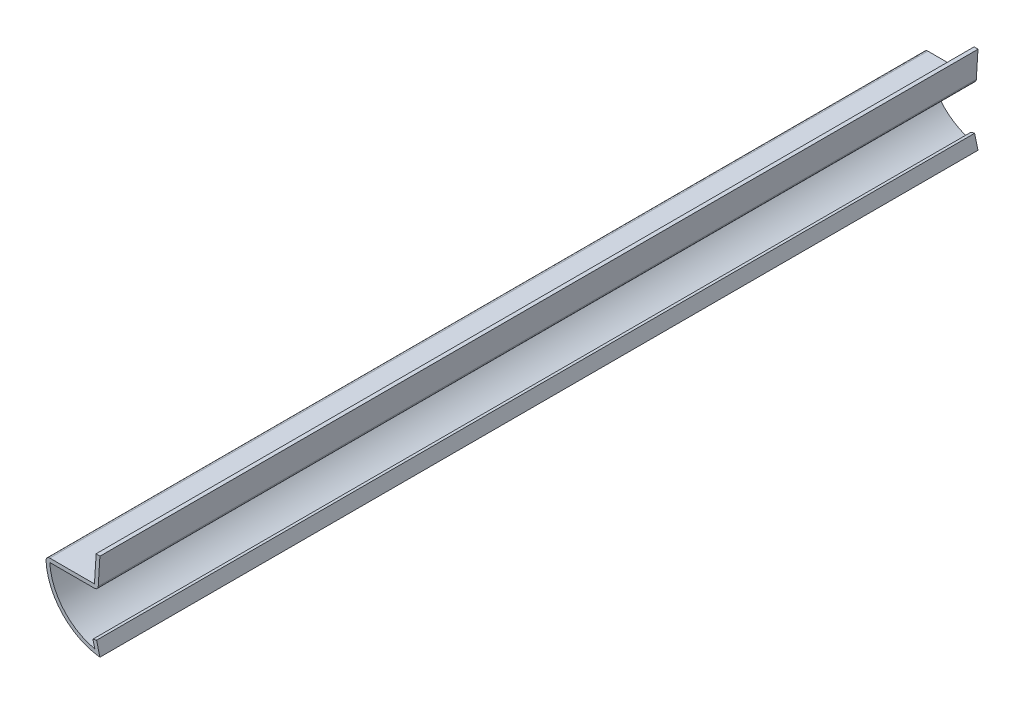
ISO-10303-21;
HEADER;
FILE_DESCRIPTION(('STEP AP214'),'2;1');
FILE_NAME('part.step','',(''),(''),'','','');
FILE_SCHEMA(('AUTOMOTIVE_DESIGN { 1 0 10303 214 1 1 1 1 }'));
ENDSEC;
DATA;
#1=APPLICATION_CONTEXT('core data for automotive mechanical design processes');
#2=APPLICATION_PROTOCOL_DEFINITION('international standard','automotive_design',2000,#1);
#3=PRODUCT_CONTEXT('',#1,'mechanical');
#4=PRODUCT('Part','Part','',(#3));
#5=PRODUCT_RELATED_PRODUCT_CATEGORY('part','',(#4));
#6=PRODUCT_DEFINITION_FORMATION('','',#4);
#7=PRODUCT_DEFINITION_CONTEXT('part definition',#1,'design');
#8=PRODUCT_DEFINITION('design','',#6,#7);
#9=PRODUCT_DEFINITION_SHAPE('','',#8);
#10=(LENGTH_UNIT() NAMED_UNIT(*) SI_UNIT(.MILLI.,.METRE.));
#11=(NAMED_UNIT(*) PLANE_ANGLE_UNIT() SI_UNIT($,.RADIAN.));
#12=(NAMED_UNIT(*) SI_UNIT($,.STERADIAN.) SOLID_ANGLE_UNIT());
#13=UNCERTAINTY_MEASURE_WITH_UNIT(LENGTH_MEASURE(1.E-05),#10,'distance_accuracy_value','');
#14=(GEOMETRIC_REPRESENTATION_CONTEXT(3) GLOBAL_UNCERTAINTY_ASSIGNED_CONTEXT((#13)) GLOBAL_UNIT_ASSIGNED_CONTEXT((#10,
#11,#12)) REPRESENTATION_CONTEXT('',''));
#15=CARTESIAN_POINT('',(0.,0.,0.));
#16=DIRECTION('',(0.,0.,1.));
#17=DIRECTION('',(1.,0.,0.));
#18=AXIS2_PLACEMENT_3D('',#15,#16,#17);
#19=CARTESIAN_POINT('',(-0.398613027077825,14.2319375,-206.375));
#20=DIRECTION('',(0.998044963916957,-0.0625,0.));
#21=DIRECTION('',(0.0625,0.998044963916957,0.));
#22=AXIS2_PLACEMENT_3D('',#19,#20,#21);
#23=PLANE('',#22);
#24=DIRECTION('',(0.0625,0.998044963916957,0.));
#25=VECTOR('',#24,1.);
#26=CARTESIAN_POINT('',(-0.398613027077825,14.2319375,0.));
#27=LINE('',#26,#25);
#28=CARTESIAN_POINT('',(-0.398613027077825,14.2319375,0.));
#29=VERTEX_POINT('',#28);
#30=CARTESIAN_POINT('',(-0.00173802707782516,20.5695230208727,0.));
#31=VERTEX_POINT('',#30);
#32=EDGE_CURVE('E227',#29,#31,#27,.T.);
#33=ORIENTED_EDGE('',*,*,#32,.F.);
#34=DIRECTION('',(0.,0.,1.));
#35=VECTOR('',#34,1.);
#36=CARTESIAN_POINT('',(-0.398613027077825,14.2319375,-206.375));
#37=LINE('',#36,#35);
#38=CARTESIAN_POINT('',(-0.398613027077825,14.2319375,-206.375));
#39=VERTEX_POINT('',#38);
#40=EDGE_CURVE('E131',#29,#39,#37,.F.);
#41=ORIENTED_EDGE('',*,*,#40,.T.);
#42=DIRECTION('',(0.0625,0.998044963916957,0.));
#43=VECTOR('',#42,1.);
#44=CARTESIAN_POINT('',(-0.398613027077825,14.2319375,-206.375));
#45=LINE('',#44,#43);
#46=CARTESIAN_POINT('',(-0.00173802707782516,20.5695230208727,-206.375));
#47=VERTEX_POINT('',#46);
#48=EDGE_CURVE('E124',#39,#47,#45,.T.);
#49=ORIENTED_EDGE('',*,*,#48,.T.);
#50=DIRECTION('',(0.,0.,1.));
#51=VECTOR('',#50,1.);
#52=CARTESIAN_POINT('',(-0.00173802707782516,20.5695230208727,-206.375));
#53=LINE('',#52,#51);
#54=EDGE_CURVE('E128',#47,#31,#53,.T.);
#55=ORIENTED_EDGE('',*,*,#54,.T.);
#56=EDGE_LOOP('',(#33,#41,#49,#55));
#57=FACE_BOUND('',#56,.T.);
#58=ADVANCED_FACE('F35',(#57),#23,.T.);
#59=CARTESIAN_POINT('',(-12.7,13.3985,-206.375));
#60=DIRECTION('',(0.,-1.,0.));
#61=DIRECTION('',(0.,0.,-1.));
#62=AXIS2_PLACEMENT_3D('',#59,#60,#61);
#63=PLANE('',#62);
#64=DIRECTION('',(1.,0.,0.));
#65=VECTOR('',#64,1.);
#66=CARTESIAN_POINT('',(-12.7,13.3985,-206.375));
#67=LINE('',#66,#65);
#68=CARTESIAN_POINT('',(-11.7873354735473,13.3985,-206.375));
#69=VERTEX_POINT('',#68);
#70=CARTESIAN_POINT('',(-1.285875,13.3985,-206.375));
#71=VERTEX_POINT('',#70);
#72=EDGE_CURVE('E148',#69,#71,#67,.T.);
#73=ORIENTED_EDGE('',*,*,#72,.T.);
#74=DIRECTION('',(0.,0.,1.));
#75=VECTOR('',#74,1.);
#76=CARTESIAN_POINT('',(-1.285875,13.3985,-206.375));
#77=LINE('',#76,#75);
#78=CARTESIAN_POINT('',(-1.285875,13.3985,0.));
#79=VERTEX_POINT('',#78);
#80=EDGE_CURVE('E157',#71,#79,#77,.T.);
#81=ORIENTED_EDGE('',*,*,#80,.T.);
#82=DIRECTION('',(1.,0.,0.));
#83=VECTOR('',#82,1.);
#84=CARTESIAN_POINT('',(-12.7,13.3985,0.));
#85=LINE('',#84,#83);
#86=CARTESIAN_POINT('',(-11.7873354735473,13.3985,0.));
#87=VERTEX_POINT('',#86);
#88=EDGE_CURVE('E134',#87,#79,#85,.T.);
#89=ORIENTED_EDGE('',*,*,#88,.F.);
#90=DIRECTION('',(0.,0.,1.));
#91=VECTOR('',#90,1.);
#92=CARTESIAN_POINT('',(-11.7873354735473,13.3985,-206.375));
#93=LINE('',#92,#91);
#94=EDGE_CURVE('E161',#69,#87,#93,.T.);
#95=ORIENTED_EDGE('',*,*,#94,.F.);
#96=EDGE_LOOP('',(#73,#81,#89,#95));
#97=FACE_BOUND('',#96,.T.);
#98=ADVANCED_FACE('F234',(#97),#63,.T.);
#99=CARTESIAN_POINT('',(1.5872262883842,14.1990622563415,-206.375));
#100=DIRECTION('',(0.,0.,1.));
#101=DIRECTION('',(1.,0.,0.));
#102=AXIS2_PLACEMENT_3D('',#99,#100,#101);
#103=CYLINDRICAL_SURFACE('',#102,13.3985);
#104=CARTESIAN_POINT('',(1.5872262883842,14.1990622563415,0.));
#105=DIRECTION('',(0.,0.,1.));
#106=DIRECTION('',(1.,0.,0.));
#107=AXIS2_PLACEMENT_3D('',#104,#105,#106);
#108=CIRCLE('',#107,13.3985);
#109=CARTESIAN_POINT('',(-1.20057239005308,1.093796872592,0.));
#110=VERTEX_POINT('',#109);
#111=EDGE_CURVE('E197',#110,#87,#108,.F.);
#112=ORIENTED_EDGE('',*,*,#111,.F.);
#113=DIRECTION('',(0.,0.,1.));
#114=VECTOR('',#113,1.);
#115=CARTESIAN_POINT('',(-1.20057239005308,1.093796872592,-206.375));
#116=LINE('',#115,#114);
#117=CARTESIAN_POINT('',(-1.20057239005308,1.093796872592,-206.375));
#118=VERTEX_POINT('',#117);
#119=EDGE_CURVE('E202',#118,#110,#116,.T.);
#120=ORIENTED_EDGE('',*,*,#119,.F.);
#121=CARTESIAN_POINT('',(1.5872262883842,14.1990622563415,-206.375));
#122=DIRECTION('',(0.,0.,1.));
#123=DIRECTION('',(1.,0.,0.));
#124=AXIS2_PLACEMENT_3D('',#121,#122,#123);
#125=CIRCLE('',#124,13.3985);
#126=EDGE_CURVE('E153',#118,#69,#125,.F.);
#127=ORIENTED_EDGE('',*,*,#126,.T.);
#128=ORIENTED_EDGE('',*,*,#94,.T.);
#129=EDGE_LOOP('',(#112,#120,#127,#128));
#130=FACE_BOUND('',#129,.T.);
#131=ADVANCED_FACE('F238',(#130),#103,.F.);
#132=CARTESIAN_POINT('',(-1.6545205486946,2.85193053105214,-206.375));
#133=DIRECTION('',(-0.968245836551854,-0.25,0.));
#134=DIRECTION('',(0.25,-0.968245836551854,0.));
#135=AXIS2_PLACEMENT_3D('',#132,#133,#134);
#136=PLANE('',#135);
#137=DIRECTION('',(0.25,-0.968245836551854,0.));
#138=VECTOR('',#137,1.);
#139=CARTESIAN_POINT('',(-1.6545205486946,2.85193053105214,0.));
#140=LINE('',#139,#138);
#141=CARTESIAN_POINT('',(-1.6545205486946,2.85193053105214,0.));
#142=VERTEX_POINT('',#141);
#143=EDGE_CURVE('E194',#142,#110,#140,.T.);
#144=ORIENTED_EDGE('',*,*,#143,.F.);
#145=DIRECTION('',(0.,0.,1.));
#146=VECTOR('',#145,1.);
#147=CARTESIAN_POINT('',(-1.6545205486946,2.85193053105214,-206.375));
#148=LINE('',#147,#146);
#149=CARTESIAN_POINT('',(-1.6545205486946,2.85193053105214,-206.375));
#150=VERTEX_POINT('',#149);
#151=EDGE_CURVE('E204',#150,#142,#148,.T.);
#152=ORIENTED_EDGE('',*,*,#151,.F.);
#153=DIRECTION('',(0.25,-0.968245836551854,0.));
#154=VECTOR('',#153,1.);
#155=CARTESIAN_POINT('',(-1.6545205486946,2.85193053105214,-206.375));
#156=LINE('',#155,#154);
#157=EDGE_CURVE('E222',#150,#118,#156,.T.);
#158=ORIENTED_EDGE('',*,*,#157,.T.);
#159=ORIENTED_EDGE('',*,*,#119,.T.);
#160=EDGE_LOOP('',(#144,#152,#158,#159));
#161=FACE_BOUND('',#160,.T.);
#162=ADVANCED_FACE('F242',(#161),#136,.T.);
#163=CARTESIAN_POINT('',(-1.6545205486946,2.85193053105214,-206.375));
#164=DIRECTION('',(0.25,-0.968245836551854,0.));
#165=DIRECTION('',(0.968245836551854,0.25,0.));
#166=AXIS2_PLACEMENT_3D('',#163,#164,#165);
#167=PLANE('',#166);
#168=DIRECTION('',(0.968245836551854,0.25,0.));
#169=VECTOR('',#168,1.);
#170=CARTESIAN_POINT('',(-1.6545205486946,2.85193053105214,0.));
#171=LINE('',#170,#169);
#172=CARTESIAN_POINT('',(-0.79375,3.07418053105214,0.));
#173=VERTEX_POINT('',#172);
#174=EDGE_CURVE('E192',#142,#173,#171,.T.);
#175=ORIENTED_EDGE('',*,*,#174,.T.);
#176=DIRECTION('',(0.,0.,1.));
#177=VECTOR('',#176,1.);
#178=CARTESIAN_POINT('',(-0.79375,3.07418053105214,-206.375));
#179=LINE('',#178,#177);
#180=CARTESIAN_POINT('',(-0.79375,3.07418053105214,-206.375));
#181=VERTEX_POINT('',#180);
#182=EDGE_CURVE('E206',#181,#173,#179,.T.);
#183=ORIENTED_EDGE('',*,*,#182,.F.);
#184=DIRECTION('',(0.968245836551854,0.25,0.));
#185=VECTOR('',#184,1.);
#186=CARTESIAN_POINT('',(-1.6545205486946,2.85193053105214,-206.375));
#187=LINE('',#186,#185);
#188=EDGE_CURVE('E220',#150,#181,#187,.T.);
#189=ORIENTED_EDGE('',*,*,#188,.F.);
#190=ORIENTED_EDGE('',*,*,#151,.T.);
#191=EDGE_LOOP('',(#175,#183,#189,#190));
#192=FACE_BOUND('',#191,.T.);
#193=ADVANCED_FACE('F247',(#192),#167,.F.);
#194=CARTESIAN_POINT('',(-0.79375,3.07418053105214,-206.375));
#195=DIRECTION('',(-0.968245836551854,-0.25,0.));
#196=DIRECTION('',(0.25,-0.968245836551854,0.));
#197=AXIS2_PLACEMENT_3D('',#194,#195,#196);
#198=PLANE('',#197);
#199=DIRECTION('',(0.25,-0.968245836551854,0.));
#200=VECTOR('',#199,1.);
#201=CARTESIAN_POINT('',(-0.79375,3.07418053105214,0.));
#202=LINE('',#201,#200);
#203=CARTESIAN_POINT('',(0.,0.,0.));
#204=VERTEX_POINT('',#203);
#205=EDGE_CURVE('E186',#173,#204,#202,.T.);
#206=ORIENTED_EDGE('',*,*,#205,.T.);
#207=DIRECTION('',(0.,0.,1.));
#208=VECTOR('',#207,1.);
#209=CARTESIAN_POINT('',(0.,0.,-206.375));
#210=LINE('',#209,#208);
#211=CARTESIAN_POINT('',(0.,0.,-206.375));
#212=VERTEX_POINT('',#211);
#213=EDGE_CURVE('E209',#212,#204,#210,.T.);
#214=ORIENTED_EDGE('',*,*,#213,.F.);
#215=DIRECTION('',(0.25,-0.968245836551854,0.));
#216=VECTOR('',#215,1.);
#217=CARTESIAN_POINT('',(-0.79375,3.07418053105214,-206.375));
#218=LINE('',#217,#216);
#219=EDGE_CURVE('E218',#181,#212,#218,.T.);
#220=ORIENTED_EDGE('',*,*,#219,.F.);
#221=ORIENTED_EDGE('',*,*,#182,.T.);
#222=EDGE_LOOP('',(#206,#214,#220,#221));
#223=FACE_BOUND('',#222,.T.);
#224=ADVANCED_FACE('F251',(#223),#198,.F.);
#225=CARTESIAN_POINT('',(1.5872262883842,14.1990622563415,-206.375));
#226=DIRECTION('',(0.,0.,1.));
#227=DIRECTION('',(1.,0.,0.));
#228=AXIS2_PLACEMENT_3D('',#225,#226,#227);
#229=CYLINDRICAL_SURFACE('',#228,14.2875);
#230=CARTESIAN_POINT('',(1.5872262883842,14.1990622563415,0.));
#231=DIRECTION('',(0.,0.,-1.));
#232=DIRECTION('',(-1.,0.,0.));
#233=AXIS2_PLACEMENT_3D('',#230,#231,#232);
#234=CIRCLE('',#233,14.2875);
#235=CARTESIAN_POINT('',(-12.6747471544338,13.3453821251717,0.));
#236=VERTEX_POINT('',#235);
#237=EDGE_CURVE('E184',#204,#236,#234,.T.);
#238=ORIENTED_EDGE('',*,*,#237,.T.);
#239=DIRECTION('',(0.,0.,1.));
#240=VECTOR('',#239,1.);
#241=CARTESIAN_POINT('',(-12.6747471544338,13.3453821251717,-206.375));
#242=LINE('',#241,#240);
#243=CARTESIAN_POINT('',(-12.6747471544338,13.3453821251717,-206.375));
#244=VERTEX_POINT('',#243);
#245=EDGE_CURVE('E11',#236,#244,#242,.F.);
#246=ORIENTED_EDGE('',*,*,#245,.T.);
#247=CARTESIAN_POINT('',(1.5872262883842,14.1990622563415,-206.375));
#248=DIRECTION('',(0.,0.,-1.));
#249=DIRECTION('',(-1.,0.,0.));
#250=AXIS2_PLACEMENT_3D('',#247,#248,#249);
#251=CIRCLE('',#250,14.2875);
#252=EDGE_CURVE('E214',#212,#244,#251,.T.);
#253=ORIENTED_EDGE('',*,*,#252,.F.);
#254=ORIENTED_EDGE('',*,*,#213,.T.);
#255=EDGE_LOOP('',(#238,#246,#253,#254));
#256=FACE_BOUND('',#255,.T.);
#257=ADVANCED_FACE('F253',(#256),#229,.T.);
#258=CARTESIAN_POINT('',(-12.7,14.2875,-206.375));
#259=DIRECTION('',(0.,-1.,0.));
#260=DIRECTION('',(0.,0.,-1.));
#261=AXIS2_PLACEMENT_3D('',#258,#259,#260);
#262=PLANE('',#261);
#263=DIRECTION('',(1.,0.,0.));
#264=VECTOR('',#263,1.);
#265=CARTESIAN_POINT('',(-12.7,14.2875,-206.375));
#266=LINE('',#265,#264);
#267=CARTESIAN_POINT('',(-11.7873354735473,14.2875,-206.375));
#268=VERTEX_POINT('',#267);
#269=CARTESIAN_POINT('',(-1.285875,14.2875,-206.375));
#270=VERTEX_POINT('',#269);
#271=EDGE_CURVE('E176',#268,#270,#266,.T.);
#272=ORIENTED_EDGE('',*,*,#271,.F.);
#273=DIRECTION('',(0.,0.,1.));
#274=VECTOR('',#273,1.);
#275=CARTESIAN_POINT('',(-11.7873354735473,14.2875,-206.375));
#276=LINE('',#275,#274);
#277=CARTESIAN_POINT('',(-11.7873354735473,14.2875,0.));
#278=VERTEX_POINT('',#277);
#279=EDGE_CURVE('E43',#268,#278,#276,.T.);
#280=ORIENTED_EDGE('',*,*,#279,.T.);
#281=DIRECTION('',(1.,0.,0.));
#282=VECTOR('',#281,1.);
#283=CARTESIAN_POINT('',(-12.7,14.2875,0.));
#284=LINE('',#283,#282);
#285=CARTESIAN_POINT('',(-1.285875,14.2875,0.));
#286=VERTEX_POINT('',#285);
#287=EDGE_CURVE('E174',#278,#286,#284,.T.);
#288=ORIENTED_EDGE('',*,*,#287,.T.);
#289=DIRECTION('',(0.,0.,1.));
#290=VECTOR('',#289,1.);
#291=CARTESIAN_POINT('',(-1.285875,14.2875,-206.375));
#292=LINE('',#291,#290);
#293=EDGE_CURVE('E150',#270,#286,#292,.T.);
#294=ORIENTED_EDGE('',*,*,#293,.F.);
#295=EDGE_LOOP('',(#272,#280,#288,#294));
#296=FACE_BOUND('',#295,.T.);
#297=ADVANCED_FACE('F172',(#296),#262,.F.);
#298=CARTESIAN_POINT('',(-1.285875,14.2875,-206.375));
#299=DIRECTION('',(0.998044963916957,-0.0625,0.));
#300=DIRECTION('',(0.0625,0.998044963916957,0.));
#301=AXIS2_PLACEMENT_3D('',#298,#299,#300);
#302=PLANE('',#301);
#303=DIRECTION('',(0.0625,0.998044963916957,0.));
#304=VECTOR('',#303,1.);
#305=CARTESIAN_POINT('',(-1.285875,14.2875,0.));
#306=LINE('',#305,#304);
#307=CARTESIAN_POINT('',(-0.889,20.6250855208727,0.));
#308=VERTEX_POINT('',#307);
#309=EDGE_CURVE('E183',#286,#308,#306,.T.);
#310=ORIENTED_EDGE('',*,*,#309,.T.);
#311=DIRECTION('',(0.,0.,1.));
#312=VECTOR('',#311,1.);
#313=CARTESIAN_POINT('',(-0.889,20.6250855208727,-206.375));
#314=LINE('',#313,#312);
#315=CARTESIAN_POINT('',(-0.889,20.6250855208727,-206.375));
#316=VERTEX_POINT('',#315);
#317=EDGE_CURVE('E147',#316,#308,#314,.T.);
#318=ORIENTED_EDGE('',*,*,#317,.F.);
#319=DIRECTION('',(0.0625,0.998044963916957,0.));
#320=VECTOR('',#319,1.);
#321=CARTESIAN_POINT('',(-1.285875,14.2875,-206.375));
#322=LINE('',#321,#320);
#323=EDGE_CURVE('E139',#270,#316,#322,.T.);
#324=ORIENTED_EDGE('',*,*,#323,.F.);
#325=ORIENTED_EDGE('',*,*,#293,.T.);
#326=EDGE_LOOP('',(#310,#318,#324,#325));
#327=FACE_BOUND('',#326,.T.);
#328=ADVANCED_FACE('F212',(#327),#302,.F.);
#329=CARTESIAN_POINT('',(-0.889,20.6250855208727,-206.375));
#330=DIRECTION('',(-0.0624999999999981,-0.998044963916957,0.));
#331=DIRECTION('',(0.998044963916957,-0.0624999999999981,0.));
#332=AXIS2_PLACEMENT_3D('',#329,#330,#331);
#333=PLANE('',#332);
#334=DIRECTION('',(0.998044963916957,-0.0624999999999981,0.));
#335=VECTOR('',#334,1.);
#336=CARTESIAN_POINT('',(-0.889,20.6250855208727,0.));
#337=LINE('',#336,#335);
#338=EDGE_CURVE('E146',#308,#31,#337,.T.);
#339=ORIENTED_EDGE('',*,*,#338,.T.);
#340=ORIENTED_EDGE('',*,*,#54,.F.);
#341=DIRECTION('',(0.998044963916957,-0.0624999999999981,0.));
#342=VECTOR('',#341,1.);
#343=CARTESIAN_POINT('',(-0.889,20.6250855208727,-206.375));
#344=LINE('',#343,#342);
#345=EDGE_CURVE('E133',#316,#47,#344,.T.);
#346=ORIENTED_EDGE('',*,*,#345,.F.);
#347=ORIENTED_EDGE('',*,*,#317,.T.);
#348=EDGE_LOOP('',(#339,#340,#346,#347));
#349=FACE_BOUND('',#348,.T.);
#350=ADVANCED_FACE('F144',(#349),#333,.F.);
#351=CARTESIAN_POINT('',(1.5872262883842,14.1990622563415,-206.375));
#352=DIRECTION('',(0.,0.,-1.));
#353=DIRECTION('',(-1.,0.,0.));
#354=AXIS2_PLACEMENT_3D('',#351,#352,#353);
#355=PLANE('',#354);
#356=ORIENTED_EDGE('',*,*,#48,.F.);
#357=CARTESIAN_POINT('',(-1.285875,14.2875,-206.375));
#358=DIRECTION('',(0.,0.,-1.));
#359=DIRECTION('',(-1.,0.,0.));
#360=AXIS2_PLACEMENT_3D('',#357,#358,#359);
#361=CIRCLE('',#360,0.889);
#362=EDGE_CURVE('E167',#39,#71,#361,.T.);
#363=ORIENTED_EDGE('',*,*,#362,.T.);
#364=ORIENTED_EDGE('',*,*,#72,.F.);
#365=ORIENTED_EDGE('',*,*,#126,.F.);
#366=ORIENTED_EDGE('',*,*,#157,.F.);
#367=ORIENTED_EDGE('',*,*,#188,.T.);
#368=ORIENTED_EDGE('',*,*,#219,.T.);
#369=ORIENTED_EDGE('',*,*,#252,.T.);
#370=CARTESIAN_POINT('',(-11.7873354735473,13.3985,-206.375));
#371=DIRECTION('',(0.,0.,-1.));
#372=DIRECTION('',(-1.,0.,0.));
#373=AXIS2_PLACEMENT_3D('',#370,#371,#372);
#374=CIRCLE('',#373,0.889);
#375=EDGE_CURVE('E50',#244,#268,#374,.T.);
#376=ORIENTED_EDGE('',*,*,#375,.T.);
#377=ORIENTED_EDGE('',*,*,#271,.T.);
#378=ORIENTED_EDGE('',*,*,#323,.T.);
#379=ORIENTED_EDGE('',*,*,#345,.T.);
#380=EDGE_LOOP('',(#356,#363,#364,#365,#366,#367,#368,#369,#376,#377,#378,#379));
#381=FACE_BOUND('',#380,.T.);
#382=ADVANCED_FACE('F137',(#381),#355,.T.);
#383=CARTESIAN_POINT('',(1.5872262883842,14.1990622563415,0.));
#384=DIRECTION('',(0.,0.,-1.));
#385=DIRECTION('',(-1.,0.,0.));
#386=AXIS2_PLACEMENT_3D('',#383,#384,#385);
#387=PLANE('',#386);
#388=ORIENTED_EDGE('',*,*,#88,.T.);
#389=CARTESIAN_POINT('',(-1.285875,14.2875,0.));
#390=DIRECTION('',(0.,0.,-1.));
#391=DIRECTION('',(-1.,0.,0.));
#392=AXIS2_PLACEMENT_3D('',#389,#390,#391);
#393=CIRCLE('',#392,0.889);
#394=EDGE_CURVE('E163',#79,#29,#393,.F.);
#395=ORIENTED_EDGE('',*,*,#394,.T.);
#396=ORIENTED_EDGE('',*,*,#32,.T.);
#397=ORIENTED_EDGE('',*,*,#338,.F.);
#398=ORIENTED_EDGE('',*,*,#309,.F.);
#399=ORIENTED_EDGE('',*,*,#287,.F.);
#400=CARTESIAN_POINT('',(-11.7873354735473,13.3985,0.));
#401=DIRECTION('',(0.,0.,-1.));
#402=DIRECTION('',(-1.,0.,0.));
#403=AXIS2_PLACEMENT_3D('',#400,#401,#402);
#404=CIRCLE('',#403,0.889);
#405=EDGE_CURVE('E160',#278,#236,#404,.F.);
#406=ORIENTED_EDGE('',*,*,#405,.T.);
#407=ORIENTED_EDGE('',*,*,#237,.F.);
#408=ORIENTED_EDGE('',*,*,#205,.F.);
#409=ORIENTED_EDGE('',*,*,#174,.F.);
#410=ORIENTED_EDGE('',*,*,#143,.T.);
#411=ORIENTED_EDGE('',*,*,#111,.T.);
#412=EDGE_LOOP('',(#388,#395,#396,#397,#398,#399,#406,#407,#408,#409,#410,#411));
#413=FACE_BOUND('',#412,.T.);
#414=ADVANCED_FACE('F181',(#413),#387,.F.);
#415=CARTESIAN_POINT('',(-1.285875,14.2875,-206.375));
#416=DIRECTION('',(0.,0.,1.));
#417=DIRECTION('',(1.,0.,0.));
#418=AXIS2_PLACEMENT_3D('',#415,#416,#417);
#419=CYLINDRICAL_SURFACE('',#418,0.889);
#420=ORIENTED_EDGE('',*,*,#362,.F.);
#421=ORIENTED_EDGE('',*,*,#40,.F.);
#422=ORIENTED_EDGE('',*,*,#394,.F.);
#423=ORIENTED_EDGE('',*,*,#80,.F.);
#424=EDGE_LOOP('',(#420,#421,#422,#423));
#425=FACE_BOUND('',#424,.T.);
#426=ADVANCED_FACE('F229',(#425),#419,.T.);
#427=CARTESIAN_POINT('',(-11.7873354735473,13.3985,-206.375));
#428=DIRECTION('',(0.,0.,1.));
#429=DIRECTION('',(1.,0.,0.));
#430=AXIS2_PLACEMENT_3D('',#427,#428,#429);
#431=CYLINDRICAL_SURFACE('',#430,0.889);
#432=ORIENTED_EDGE('',*,*,#375,.F.);
#433=ORIENTED_EDGE('',*,*,#245,.F.);
#434=ORIENTED_EDGE('',*,*,#405,.F.);
#435=ORIENTED_EDGE('',*,*,#279,.F.);
#436=EDGE_LOOP('',(#432,#433,#434,#435));
#437=FACE_BOUND('',#436,.T.);
#438=ADVANCED_FACE('F37',(#437),#431,.T.);
#439=CLOSED_SHELL('',(#58,#98,#131,#162,#193,#224,#257,#297,#328,#350,#382,#414,#426,#438));
#440=MANIFOLD_SOLID_BREP('B2',#439);
#441=ADVANCED_BREP_SHAPE_REPRESENTATION('',(#18,#440),#14);
#442=SHAPE_DEFINITION_REPRESENTATION(#9,#441);
ENDSEC;
END-ISO-10303-21;
